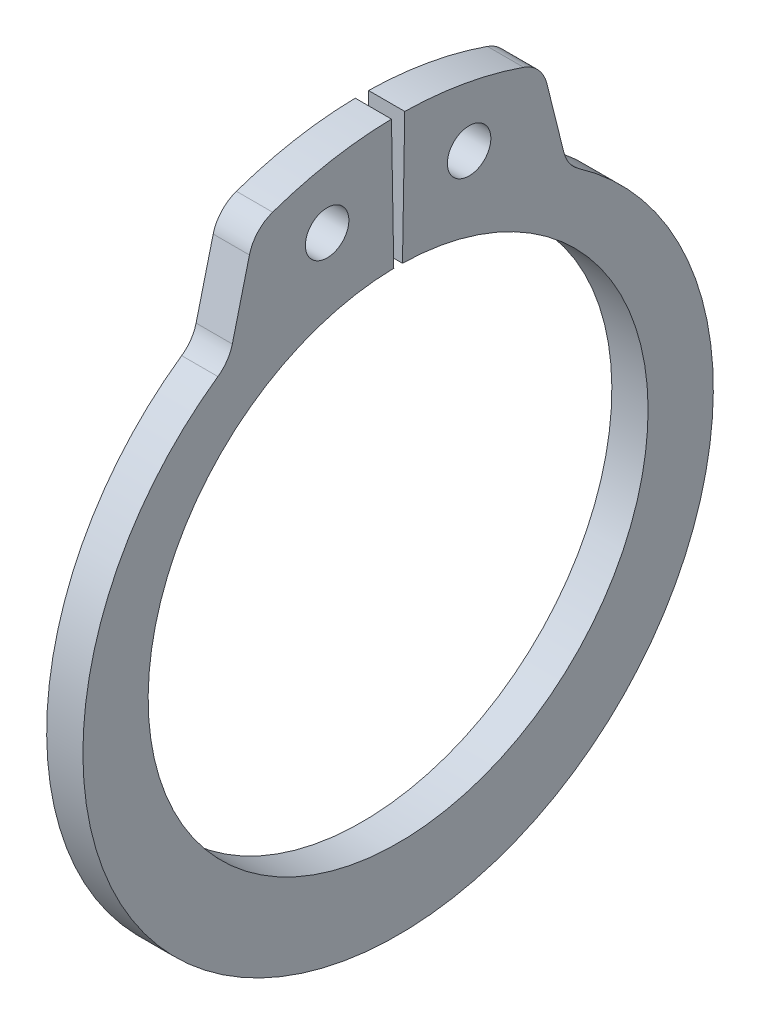
ISO-10303-21;
HEADER;
FILE_DESCRIPTION(('STEP AP214'),'2;1');
FILE_NAME('part.step','',(''),(''),'','','');
FILE_SCHEMA(('AUTOMOTIVE_DESIGN { 1 0 10303 214 1 1 1 1 }'));
ENDSEC;
DATA;
#1=APPLICATION_CONTEXT('core data for automotive mechanical design processes');
#2=APPLICATION_PROTOCOL_DEFINITION('international standard','automotive_design',2000,#1);
#3=PRODUCT_CONTEXT('',#1,'mechanical');
#4=PRODUCT('Part','Part','',(#3));
#5=PRODUCT_RELATED_PRODUCT_CATEGORY('part','',(#4));
#6=PRODUCT_DEFINITION_FORMATION('','',#4);
#7=PRODUCT_DEFINITION_CONTEXT('part definition',#1,'design');
#8=PRODUCT_DEFINITION('design','',#6,#7);
#9=PRODUCT_DEFINITION_SHAPE('','',#8);
#10=(LENGTH_UNIT() NAMED_UNIT(*) SI_UNIT(.MILLI.,.METRE.));
#11=(NAMED_UNIT(*) PLANE_ANGLE_UNIT() SI_UNIT($,.RADIAN.));
#12=(NAMED_UNIT(*) SI_UNIT($,.STERADIAN.) SOLID_ANGLE_UNIT());
#13=UNCERTAINTY_MEASURE_WITH_UNIT(LENGTH_MEASURE(1.E-05),#10,'distance_accuracy_value','');
#14=(GEOMETRIC_REPRESENTATION_CONTEXT(3) GLOBAL_UNCERTAINTY_ASSIGNED_CONTEXT((#13)) GLOBAL_UNIT_ASSIGNED_CONTEXT((#10,
#11,#12)) REPRESENTATION_CONTEXT('',''));
#15=CARTESIAN_POINT('',(0.,0.,0.));
#16=DIRECTION('',(0.,0.,1.));
#17=DIRECTION('',(1.,0.,0.));
#18=AXIS2_PLACEMENT_3D('',#15,#16,#17);
#19=CARTESIAN_POINT('',(-0.5,0.,0.));
#20=DIRECTION('',(1.,0.,0.));
#21=DIRECTION('',(0.,0.,-1.));
#22=AXIS2_PLACEMENT_3D('',#19,#20,#21);
#23=PLANE('',#22);
#24=CARTESIAN_POINT('',(-0.5,8.66711980549086,-1.9596288316201));
#25=DIRECTION('',(-1.,0.,0.));
#26=DIRECTION('',(0.,0.,1.));
#27=AXIS2_PLACEMENT_3D('',#24,#25,#26);
#28=CIRCLE('',#27,0.6);
#29=CARTESIAN_POINT('',(-0.5,8.66711980549086,-1.3596288316201));
#30=VERTEX_POINT('',#29);
#31=EDGE_CURVE('E126',#30,#30,#28,.F.);
#32=ORIENTED_EDGE('',*,*,#31,.T.);
#33=EDGE_LOOP('',(#32));
#34=FACE_BOUND('',#33,.T.);
#35=CARTESIAN_POINT('',(-0.5,8.96816184312502,3.13401869099666));
#36=DIRECTION('',(-1.,0.,0.));
#37=DIRECTION('',(0.,0.,1.));
#38=AXIS2_PLACEMENT_3D('',#35,#36,#37);
#39=CIRCLE('',#38,1.);
#40=CARTESIAN_POINT('',(-0.5,9.91217887924345,3.46391539531209));
#41=VERTEX_POINT('',#40);
#42=CARTESIAN_POINT('',(-0.5,9.21008373872469,4.10431441727265));
#43=VERTEX_POINT('',#42);
#44=EDGE_CURVE('E112',#41,#43,#39,.F.);
#45=ORIENTED_EDGE('',*,*,#44,.F.);
#46=CARTESIAN_POINT('',(-0.5,0.,0.));
#47=DIRECTION('',(-1.,0.,0.));
#48=DIRECTION('',(0.,0.,1.));
#49=AXIS2_PLACEMENT_3D('',#46,#47,#48);
#50=CIRCLE('',#49,10.5);
#51=CARTESIAN_POINT('',(-0.5,10.4984007991421,0.183250267591477));
#52=VERTEX_POINT('',#51);
#53=EDGE_CURVE('E105',#52,#41,#50,.F.);
#54=ORIENTED_EDGE('',*,*,#53,.F.);
#55=DIRECTION('',(0.,-0.999847695156391,-0.0174524064372835));
#56=VECTOR('',#55,1.);
#57=CARTESIAN_POINT('',(-0.5,6.8989490965791,0.120421604417256));
#58=LINE('',#57,#56);
#59=CARTESIAN_POINT('',(-0.5,6.8989490965791,0.120421604417256));
#60=VERTEX_POINT('',#59);
#61=EDGE_CURVE('E109',#52,#60,#58,.T.);
#62=ORIENTED_EDGE('',*,*,#61,.T.);
#63=CARTESIAN_POINT('',(-0.5,0.,0.));
#64=DIRECTION('',(-1.,0.,0.));
#65=DIRECTION('',(0.,0.,1.));
#66=AXIS2_PLACEMENT_3D('',#63,#64,#65);
#67=CIRCLE('',#66,6.9);
#68=CARTESIAN_POINT('',(-0.5,6.8989490965791,-0.120421604417256));
#69=VERTEX_POINT('',#68);
#70=EDGE_CURVE('E172',#60,#69,#67,.F.);
#71=ORIENTED_EDGE('',*,*,#70,.T.);
#72=DIRECTION('',(0.,0.999847695156391,-0.0174524064372841));
#73=VECTOR('',#72,1.);
#74=CARTESIAN_POINT('',(-0.5,10.4984007991421,-0.183250267591479));
#75=LINE('',#74,#73);
#76=CARTESIAN_POINT('',(-0.5,10.4984007991421,-0.183250267591479));
#77=VERTEX_POINT('',#76);
#78=EDGE_CURVE('E134',#69,#77,#75,.T.);
#79=ORIENTED_EDGE('',*,*,#78,.T.);
#80=CARTESIAN_POINT('',(-0.5,0.,0.));
#81=DIRECTION('',(-1.,0.,0.));
#82=DIRECTION('',(0.,0.,1.));
#83=AXIS2_PLACEMENT_3D('',#80,#81,#82);
#84=CIRCLE('',#83,10.5);
#85=CARTESIAN_POINT('',(-0.5,9.91217887924345,-3.46391539531209));
#86=VERTEX_POINT('',#85);
#87=EDGE_CURVE('E174',#86,#77,#84,.F.);
#88=ORIENTED_EDGE('',*,*,#87,.F.);
#89=CARTESIAN_POINT('',(-0.5,8.96816184312502,-3.13401869099665));
#90=DIRECTION('',(-1.,0.,0.));
#91=DIRECTION('',(0.,0.,1.));
#92=AXIS2_PLACEMENT_3D('',#89,#90,#91);
#93=CIRCLE('',#92,1.);
#94=CARTESIAN_POINT('',(-0.5,9.21008373872469,-4.10431441727265));
#95=VERTEX_POINT('',#94);
#96=EDGE_CURVE('E177',#95,#86,#93,.F.);
#97=ORIENTED_EDGE('',*,*,#96,.F.);
#98=DIRECTION('',(0.,-0.970295726275997,-0.241921895599666));
#99=VECTOR('',#98,1.);
#100=CARTESIAN_POINT('',(-0.5,9.71734472745919,-3.97784004803122));
#101=LINE('',#100,#99);
#102=CARTESIAN_POINT('',(-0.5,7.31761530924591,-4.57615979123836));
#103=VERTEX_POINT('',#102);
#104=EDGE_CURVE('E139',#95,#103,#101,.T.);
#105=ORIENTED_EDGE('',*,*,#104,.T.);
#106=CARTESIAN_POINT('',(-0.5,7.55953720484558,-5.54645551751436));
#107=DIRECTION('',(-1.,0.,0.));
#108=DIRECTION('',(0.,0.,1.));
#109=AXIS2_PLACEMENT_3D('',#106,#107,#108);
#110=CIRCLE('',#109,1.);
#111=CARTESIAN_POINT('',(-0.5,6.73911195964233,-4.97470170945253));
#112=VERTEX_POINT('',#111);
#113=EDGE_CURVE('E179',#103,#112,#110,.F.);
#114=ORIENTED_EDGE('',*,*,#113,.T.);
#115=CARTESIAN_POINT('',(-0.5,-0.399224177769538,0.));
#116=DIRECTION('',(-1.,0.,0.));
#117=DIRECTION('',(0.,0.,1.));
#118=AXIS2_PLACEMENT_3D('',#115,#116,#117);
#119=CIRCLE('',#118,8.70077582223046);
#120=CARTESIAN_POINT('',(-0.5,6.73911195964233,4.97470170945253));
#121=VERTEX_POINT('',#120);
#122=EDGE_CURVE('E182',#121,#112,#119,.F.);
#123=ORIENTED_EDGE('',*,*,#122,.F.);
#124=CARTESIAN_POINT('',(-0.5,7.55953720484558,5.54645551751436));
#125=DIRECTION('',(-1.,0.,0.));
#126=DIRECTION('',(0.,0.,1.));
#127=AXIS2_PLACEMENT_3D('',#124,#125,#126);
#128=CIRCLE('',#127,1.);
#129=CARTESIAN_POINT('',(-0.5,7.31761530924591,4.57615979123836));
#130=VERTEX_POINT('',#129);
#131=EDGE_CURVE('E145',#121,#130,#128,.F.);
#132=ORIENTED_EDGE('',*,*,#131,.T.);
#133=DIRECTION('',(0.,0.970295726275997,-0.241921895599665));
#134=VECTOR('',#133,1.);
#135=CARTESIAN_POINT('',(-0.5,9.71734472745919,3.97784004803122));
#136=LINE('',#135,#134);
#137=EDGE_CURVE('E144',#130,#43,#136,.T.);
#138=ORIENTED_EDGE('',*,*,#137,.T.);
#139=EDGE_LOOP('',(#45,#54,#62,#71,#79,#88,#97,#105,#114,#123,#132,#138));
#140=FACE_BOUND('',#139,.T.);
#141=CARTESIAN_POINT('',(-0.5,8.66711980549086,1.9596288316201));
#142=DIRECTION('',(-1.,0.,0.));
#143=DIRECTION('',(0.,0.,1.));
#144=AXIS2_PLACEMENT_3D('',#141,#142,#143);
#145=CIRCLE('',#144,0.6);
#146=CARTESIAN_POINT('',(-0.5,8.66711980549086,2.5596288316201));
#147=VERTEX_POINT('',#146);
#148=EDGE_CURVE('E20',#147,#147,#145,.F.);
#149=ORIENTED_EDGE('',*,*,#148,.T.);
#150=EDGE_LOOP('',(#149));
#151=FACE_BOUND('',#150,.T.);
#152=ADVANCED_FACE('F17',(#34,#140,#151),#23,.F.);
#153=CARTESIAN_POINT('',(0.5,8.66711980549086,1.9596288316201));
#154=DIRECTION('',(-1.,0.,0.));
#155=DIRECTION('',(0.,0.,1.));
#156=AXIS2_PLACEMENT_3D('',#153,#154,#155);
#157=CYLINDRICAL_SURFACE('',#156,0.6);
#158=CARTESIAN_POINT('',(0.5,8.66711980549086,1.9596288316201));
#159=DIRECTION('',(-1.,0.,0.));
#160=DIRECTION('',(0.,0.,1.));
#161=AXIS2_PLACEMENT_3D('',#158,#159,#160);
#162=CIRCLE('',#161,0.6);
#163=CARTESIAN_POINT('',(0.5,8.66711980549086,2.5596288316201));
#164=VERTEX_POINT('',#163);
#165=EDGE_CURVE('E129',#164,#164,#162,.T.);
#166=ORIENTED_EDGE('',*,*,#165,.F.);
#167=EDGE_LOOP('',(#166));
#168=FACE_BOUND('',#167,.T.);
#169=ORIENTED_EDGE('',*,*,#148,.F.);
#170=EDGE_LOOP('',(#169));
#171=FACE_BOUND('',#170,.T.);
#172=ADVANCED_FACE('F272',(#168,#171),#157,.F.);
#173=CARTESIAN_POINT('',(0.5,0.,0.));
#174=DIRECTION('',(-1.,0.,0.));
#175=DIRECTION('',(0.,0.,1.));
#176=AXIS2_PLACEMENT_3D('',#173,#174,#175);
#177=CYLINDRICAL_SURFACE('',#176,10.5);
#178=CARTESIAN_POINT('',(0.5,0.,0.));
#179=DIRECTION('',(-1.,0.,0.));
#180=DIRECTION('',(0.,0.,1.));
#181=AXIS2_PLACEMENT_3D('',#178,#179,#180);
#182=CIRCLE('',#181,10.5);
#183=CARTESIAN_POINT('',(0.5,10.4984007991421,0.183250267591477));
#184=VERTEX_POINT('',#183);
#185=CARTESIAN_POINT('',(0.5,9.91217887924345,3.46391539531209));
#186=VERTEX_POINT('',#185);
#187=EDGE_CURVE('E120',#184,#186,#182,.F.);
#188=ORIENTED_EDGE('',*,*,#187,.F.);
#189=DIRECTION('',(1.,0.,0.));
#190=VECTOR('',#189,1.);
#191=CARTESIAN_POINT('',(0.5,10.4984007991421,0.183250267591477));
#192=LINE('',#191,#190);
#193=EDGE_CURVE('E117',#184,#52,#192,.F.);
#194=ORIENTED_EDGE('',*,*,#193,.T.);
#195=ORIENTED_EDGE('',*,*,#53,.T.);
#196=DIRECTION('',(-1.,0.,0.));
#197=VECTOR('',#196,1.);
#198=CARTESIAN_POINT('',(0.5,9.91217887924345,3.46391539531209));
#199=LINE('',#198,#197);
#200=EDGE_CURVE('E115',#186,#41,#199,.T.);
#201=ORIENTED_EDGE('',*,*,#200,.F.);
#202=EDGE_LOOP('',(#188,#194,#195,#201));
#203=FACE_BOUND('',#202,.T.);
#204=ADVANCED_FACE('F118',(#203),#177,.T.);
#205=CARTESIAN_POINT('',(0.5,8.96816184312502,3.13401869099666));
#206=DIRECTION('',(-1.,0.,0.));
#207=DIRECTION('',(0.,0.,1.));
#208=AXIS2_PLACEMENT_3D('',#205,#206,#207);
#209=CYLINDRICAL_SURFACE('',#208,1.);
#210=ORIENTED_EDGE('',*,*,#44,.T.);
#211=DIRECTION('',(1.,0.,0.));
#212=VECTOR('',#211,1.);
#213=CARTESIAN_POINT('',(0.5,9.21008373872469,4.10431441727265));
#214=LINE('',#213,#212);
#215=CARTESIAN_POINT('',(0.5,9.21008373872469,4.10431441727265));
#216=VERTEX_POINT('',#215);
#217=EDGE_CURVE('E146',#43,#216,#214,.T.);
#218=ORIENTED_EDGE('',*,*,#217,.T.);
#219=CARTESIAN_POINT('',(0.5,8.96816184312502,3.13401869099666));
#220=DIRECTION('',(-1.,0.,0.));
#221=DIRECTION('',(0.,0.,1.));
#222=AXIS2_PLACEMENT_3D('',#219,#220,#221);
#223=CIRCLE('',#222,1.);
#224=EDGE_CURVE('E166',#186,#216,#223,.F.);
#225=ORIENTED_EDGE('',*,*,#224,.F.);
#226=ORIENTED_EDGE('',*,*,#200,.T.);
#227=EDGE_LOOP('',(#210,#218,#225,#226));
#228=FACE_BOUND('',#227,.T.);
#229=ADVANCED_FACE('F190',(#228),#209,.T.);
#230=CARTESIAN_POINT('',(0.5,9.71734472745919,3.97784004803122));
#231=DIRECTION('',(0.,-0.241921895599665,-0.970295726275997));
#232=DIRECTION('',(0.,0.970295726275997,-0.241921895599665));
#233=AXIS2_PLACEMENT_3D('',#230,#231,#232);
#234=PLANE('',#233);
#235=DIRECTION('',(-1.,0.,0.));
#236=VECTOR('',#235,1.);
#237=CARTESIAN_POINT('',(0.5,7.31761530924591,4.57615979123836));
#238=LINE('',#237,#236);
#239=CARTESIAN_POINT('',(0.5,7.31761530924591,4.57615979123836));
#240=VERTEX_POINT('',#239);
#241=EDGE_CURVE('E187',#130,#240,#238,.F.);
#242=ORIENTED_EDGE('',*,*,#241,.T.);
#243=DIRECTION('',(0.,-0.970295726275997,0.241921895599665));
#244=VECTOR('',#243,1.);
#245=CARTESIAN_POINT('',(0.5,9.21008373872469,4.10431441727265));
#246=LINE('',#245,#244);
#247=EDGE_CURVE('E165',#216,#240,#246,.T.);
#248=ORIENTED_EDGE('',*,*,#247,.F.);
#249=ORIENTED_EDGE('',*,*,#217,.F.);
#250=ORIENTED_EDGE('',*,*,#137,.F.);
#251=EDGE_LOOP('',(#242,#248,#249,#250));
#252=FACE_BOUND('',#251,.T.);
#253=ADVANCED_FACE('F218',(#252),#234,.F.);
#254=CARTESIAN_POINT('',(0.5,7.55953720484558,5.54645551751436));
#255=DIRECTION('',(-1.,0.,0.));
#256=DIRECTION('',(0.,0.,1.));
#257=AXIS2_PLACEMENT_3D('',#254,#255,#256);
#258=CYLINDRICAL_SURFACE('',#257,1.);
#259=ORIENTED_EDGE('',*,*,#241,.F.);
#260=ORIENTED_EDGE('',*,*,#131,.F.);
#261=DIRECTION('',(-1.,0.,0.));
#262=VECTOR('',#261,1.);
#263=CARTESIAN_POINT('',(0.5,6.73911195964233,4.97470170945253));
#264=LINE('',#263,#262);
#265=CARTESIAN_POINT('',(0.5,6.73911195964233,4.97470170945253));
#266=VERTEX_POINT('',#265);
#267=EDGE_CURVE('E185',#266,#121,#264,.T.);
#268=ORIENTED_EDGE('',*,*,#267,.F.);
#269=CARTESIAN_POINT('',(0.5,7.55953720484558,5.54645551751436));
#270=DIRECTION('',(-1.,0.,0.));
#271=DIRECTION('',(0.,0.,1.));
#272=AXIS2_PLACEMENT_3D('',#269,#270,#271);
#273=CIRCLE('',#272,1.);
#274=EDGE_CURVE('E162',#240,#266,#273,.T.);
#275=ORIENTED_EDGE('',*,*,#274,.F.);
#276=EDGE_LOOP('',(#259,#260,#268,#275));
#277=FACE_BOUND('',#276,.T.);
#278=ADVANCED_FACE('F221',(#277),#258,.F.);
#279=CARTESIAN_POINT('',(0.5,-0.399224177769538,0.));
#280=DIRECTION('',(-1.,0.,0.));
#281=DIRECTION('',(0.,0.,1.));
#282=AXIS2_PLACEMENT_3D('',#279,#280,#281);
#283=CYLINDRICAL_SURFACE('',#282,8.70077582223046);
#284=ORIENTED_EDGE('',*,*,#122,.T.);
#285=DIRECTION('',(-1.,0.,0.));
#286=VECTOR('',#285,1.);
#287=CARTESIAN_POINT('',(0.5,6.73911195964233,-4.97470170945253));
#288=LINE('',#287,#286);
#289=CARTESIAN_POINT('',(0.5,6.73911195964233,-4.97470170945253));
#290=VERTEX_POINT('',#289);
#291=EDGE_CURVE('E181',#112,#290,#288,.F.);
#292=ORIENTED_EDGE('',*,*,#291,.T.);
#293=CARTESIAN_POINT('',(0.5,-0.399224177769538,0.));
#294=DIRECTION('',(-1.,0.,0.));
#295=DIRECTION('',(0.,0.,1.));
#296=AXIS2_PLACEMENT_3D('',#293,#294,#295);
#297=CIRCLE('',#296,8.70077582223046);
#298=EDGE_CURVE('E160',#266,#290,#297,.F.);
#299=ORIENTED_EDGE('',*,*,#298,.F.);
#300=ORIENTED_EDGE('',*,*,#267,.T.);
#301=EDGE_LOOP('',(#284,#292,#299,#300));
#302=FACE_BOUND('',#301,.T.);
#303=ADVANCED_FACE('F226',(#302),#283,.T.);
#304=CARTESIAN_POINT('',(0.5,7.55953720484558,-5.54645551751436));
#305=DIRECTION('',(-1.,0.,0.));
#306=DIRECTION('',(0.,0.,1.));
#307=AXIS2_PLACEMENT_3D('',#304,#305,#306);
#308=CYLINDRICAL_SURFACE('',#307,1.);
#309=ORIENTED_EDGE('',*,*,#291,.F.);
#310=ORIENTED_EDGE('',*,*,#113,.F.);
#311=DIRECTION('',(1.,0.,0.));
#312=VECTOR('',#311,1.);
#313=CARTESIAN_POINT('',(0.5,7.31761530924591,-4.57615979123836));
#314=LINE('',#313,#312);
#315=CARTESIAN_POINT('',(0.5,7.31761530924591,-4.57615979123836));
#316=VERTEX_POINT('',#315);
#317=EDGE_CURVE('E143',#103,#316,#314,.T.);
#318=ORIENTED_EDGE('',*,*,#317,.T.);
#319=CARTESIAN_POINT('',(0.5,7.55953720484558,-5.54645551751436));
#320=DIRECTION('',(-1.,0.,0.));
#321=DIRECTION('',(0.,0.,1.));
#322=AXIS2_PLACEMENT_3D('',#319,#320,#321);
#323=CIRCLE('',#322,1.);
#324=EDGE_CURVE('E157',#290,#316,#323,.T.);
#325=ORIENTED_EDGE('',*,*,#324,.F.);
#326=EDGE_LOOP('',(#309,#310,#318,#325));
#327=FACE_BOUND('',#326,.T.);
#328=ADVANCED_FACE('F228',(#327),#308,.F.);
#329=CARTESIAN_POINT('',(0.5,9.71734472745919,-3.97784004803122));
#330=DIRECTION('',(0.,-0.241921895599666,0.970295726275997));
#331=DIRECTION('',(0.,-0.970295726275997,-0.241921895599666));
#332=AXIS2_PLACEMENT_3D('',#329,#330,#331);
#333=PLANE('',#332);
#334=DIRECTION('',(-1.,0.,0.));
#335=VECTOR('',#334,1.);
#336=CARTESIAN_POINT('',(0.5,9.21008373872469,-4.10431441727265));
#337=LINE('',#336,#335);
#338=CARTESIAN_POINT('',(0.5,9.21008373872469,-4.10431441727265));
#339=VERTEX_POINT('',#338);
#340=EDGE_CURVE('E142',#339,#95,#337,.T.);
#341=ORIENTED_EDGE('',*,*,#340,.F.);
#342=DIRECTION('',(0.,0.970295726275997,0.241921895599666));
#343=VECTOR('',#342,1.);
#344=CARTESIAN_POINT('',(0.5,7.31761530924591,-4.57615979123836));
#345=LINE('',#344,#343);
#346=EDGE_CURVE('E156',#316,#339,#345,.T.);
#347=ORIENTED_EDGE('',*,*,#346,.F.);
#348=ORIENTED_EDGE('',*,*,#317,.F.);
#349=ORIENTED_EDGE('',*,*,#104,.F.);
#350=EDGE_LOOP('',(#341,#347,#348,#349));
#351=FACE_BOUND('',#350,.T.);
#352=ADVANCED_FACE('F232',(#351),#333,.F.);
#353=CARTESIAN_POINT('',(0.5,8.96816184312502,-3.13401869099665));
#354=DIRECTION('',(-1.,0.,0.));
#355=DIRECTION('',(0.,0.,1.));
#356=AXIS2_PLACEMENT_3D('',#353,#354,#355);
#357=CYLINDRICAL_SURFACE('',#356,1.);
#358=ORIENTED_EDGE('',*,*,#96,.T.);
#359=DIRECTION('',(-1.,0.,0.));
#360=VECTOR('',#359,1.);
#361=CARTESIAN_POINT('',(0.5,9.91217887924345,-3.46391539531209));
#362=LINE('',#361,#360);
#363=CARTESIAN_POINT('',(0.5,9.91217887924345,-3.46391539531209));
#364=VERTEX_POINT('',#363);
#365=EDGE_CURVE('E176',#364,#86,#362,.T.);
#366=ORIENTED_EDGE('',*,*,#365,.F.);
#367=CARTESIAN_POINT('',(0.5,8.96816184312502,-3.13401869099665));
#368=DIRECTION('',(-1.,0.,0.));
#369=DIRECTION('',(0.,0.,1.));
#370=AXIS2_PLACEMENT_3D('',#367,#368,#369);
#371=CIRCLE('',#370,1.);
#372=EDGE_CURVE('E153',#339,#364,#371,.F.);
#373=ORIENTED_EDGE('',*,*,#372,.F.);
#374=ORIENTED_EDGE('',*,*,#340,.T.);
#375=EDGE_LOOP('',(#358,#366,#373,#374));
#376=FACE_BOUND('',#375,.T.);
#377=ADVANCED_FACE('F236',(#376),#357,.T.);
#378=CARTESIAN_POINT('',(0.5,0.,0.));
#379=DIRECTION('',(-1.,0.,0.));
#380=DIRECTION('',(0.,0.,1.));
#381=AXIS2_PLACEMENT_3D('',#378,#379,#380);
#382=CYLINDRICAL_SURFACE('',#381,10.5);
#383=ORIENTED_EDGE('',*,*,#87,.T.);
#384=DIRECTION('',(1.,0.,0.));
#385=VECTOR('',#384,1.);
#386=CARTESIAN_POINT('',(0.5,10.4984007991421,-0.183250267591479));
#387=LINE('',#386,#385);
#388=CARTESIAN_POINT('',(0.5,10.4984007991421,-0.183250267591479));
#389=VERTEX_POINT('',#388);
#390=EDGE_CURVE('E138',#77,#389,#387,.T.);
#391=ORIENTED_EDGE('',*,*,#390,.T.);
#392=CARTESIAN_POINT('',(0.5,0.,0.));
#393=DIRECTION('',(-1.,0.,0.));
#394=DIRECTION('',(0.,0.,1.));
#395=AXIS2_PLACEMENT_3D('',#392,#393,#394);
#396=CIRCLE('',#395,10.5);
#397=EDGE_CURVE('E150',#364,#389,#396,.F.);
#398=ORIENTED_EDGE('',*,*,#397,.F.);
#399=ORIENTED_EDGE('',*,*,#365,.T.);
#400=EDGE_LOOP('',(#383,#391,#398,#399));
#401=FACE_BOUND('',#400,.T.);
#402=ADVANCED_FACE('F240',(#401),#382,.T.);
#403=CARTESIAN_POINT('',(0.5,10.4984007991421,-0.183250267591479));
#404=DIRECTION('',(0.,-0.0174524064372841,-0.999847695156391));
#405=DIRECTION('',(0.,0.999847695156391,-0.0174524064372841));
#406=AXIS2_PLACEMENT_3D('',#403,#404,#405);
#407=PLANE('',#406);
#408=DIRECTION('',(-1.,0.,0.));
#409=VECTOR('',#408,1.);
#410=CARTESIAN_POINT('',(0.5,6.8989490965791,-0.120421604417256));
#411=LINE('',#410,#409);
#412=CARTESIAN_POINT('',(0.5,6.8989490965791,-0.120421604417256));
#413=VERTEX_POINT('',#412);
#414=EDGE_CURVE('E137',#69,#413,#411,.F.);
#415=ORIENTED_EDGE('',*,*,#414,.T.);
#416=DIRECTION('',(0.,-0.999847695156391,0.017452406437284));
#417=VECTOR('',#416,1.);
#418=CARTESIAN_POINT('',(0.5,10.4984007991421,-0.183250267591479));
#419=LINE('',#418,#417);
#420=EDGE_CURVE('E149',#389,#413,#419,.T.);
#421=ORIENTED_EDGE('',*,*,#420,.F.);
#422=ORIENTED_EDGE('',*,*,#390,.F.);
#423=ORIENTED_EDGE('',*,*,#78,.F.);
#424=EDGE_LOOP('',(#415,#421,#422,#423));
#425=FACE_BOUND('',#424,.T.);
#426=ADVANCED_FACE('F245',(#425),#407,.F.);
#427=CARTESIAN_POINT('',(0.5,0.,0.));
#428=DIRECTION('',(-1.,0.,0.));
#429=DIRECTION('',(0.,0.,1.));
#430=AXIS2_PLACEMENT_3D('',#427,#428,#429);
#431=CYLINDRICAL_SURFACE('',#430,6.9);
#432=DIRECTION('',(1.,0.,0.));
#433=VECTOR('',#432,1.);
#434=CARTESIAN_POINT('',(0.5,6.8989490965791,0.120421604417256));
#435=LINE('',#434,#433);
#436=CARTESIAN_POINT('',(0.5,6.8989490965791,0.120421604417256));
#437=VERTEX_POINT('',#436);
#438=EDGE_CURVE('E123',#60,#437,#435,.T.);
#439=ORIENTED_EDGE('',*,*,#438,.T.);
#440=CARTESIAN_POINT('',(0.5,0.,0.));
#441=DIRECTION('',(-1.,0.,0.));
#442=DIRECTION('',(0.,0.,1.));
#443=AXIS2_PLACEMENT_3D('',#440,#441,#442);
#444=CIRCLE('',#443,6.9);
#445=EDGE_CURVE('E35',#413,#437,#444,.T.);
#446=ORIENTED_EDGE('',*,*,#445,.F.);
#447=ORIENTED_EDGE('',*,*,#414,.F.);
#448=ORIENTED_EDGE('',*,*,#70,.F.);
#449=EDGE_LOOP('',(#439,#446,#447,#448));
#450=FACE_BOUND('',#449,.T.);
#451=ADVANCED_FACE('F248',(#450),#431,.F.);
#452=CARTESIAN_POINT('',(0.5,6.8989490965791,0.120421604417256));
#453=DIRECTION('',(0.,-0.0174524064372835,0.999847695156391));
#454=DIRECTION('',(0.,-0.999847695156391,-0.0174524064372835));
#455=AXIS2_PLACEMENT_3D('',#452,#453,#454);
#456=PLANE('',#455);
#457=ORIENTED_EDGE('',*,*,#193,.F.);
#458=DIRECTION('',(0.,0.999847695156391,0.0174524064372835));
#459=VECTOR('',#458,1.);
#460=CARTESIAN_POINT('',(0.5,6.8989490965791,0.120421604417256));
#461=LINE('',#460,#459);
#462=EDGE_CURVE('E26',#437,#184,#461,.T.);
#463=ORIENTED_EDGE('',*,*,#462,.F.);
#464=ORIENTED_EDGE('',*,*,#438,.F.);
#465=ORIENTED_EDGE('',*,*,#61,.F.);
#466=EDGE_LOOP('',(#457,#463,#464,#465));
#467=FACE_BOUND('',#466,.T.);
#468=ADVANCED_FACE('F125',(#467),#456,.F.);
#469=CARTESIAN_POINT('',(0.5,8.66711980549086,-1.9596288316201));
#470=DIRECTION('',(-1.,0.,0.));
#471=DIRECTION('',(0.,0.,1.));
#472=AXIS2_PLACEMENT_3D('',#469,#470,#471);
#473=CYLINDRICAL_SURFACE('',#472,0.6);
#474=CARTESIAN_POINT('',(0.5,8.66711980549086,-1.9596288316201));
#475=DIRECTION('',(-1.,0.,0.));
#476=DIRECTION('',(0.,0.,1.));
#477=AXIS2_PLACEMENT_3D('',#474,#475,#476);
#478=CIRCLE('',#477,0.6);
#479=CARTESIAN_POINT('',(0.5,8.66711980549086,-1.3596288316201));
#480=VERTEX_POINT('',#479);
#481=EDGE_CURVE('E11',#480,#480,#478,.T.);
#482=ORIENTED_EDGE('',*,*,#481,.F.);
#483=EDGE_LOOP('',(#482));
#484=FACE_BOUND('',#483,.T.);
#485=ORIENTED_EDGE('',*,*,#31,.F.);
#486=EDGE_LOOP('',(#485));
#487=FACE_BOUND('',#486,.T.);
#488=ADVANCED_FACE('F256',(#484,#487),#473,.F.);
#489=CARTESIAN_POINT('',(0.5,0.,0.));
#490=DIRECTION('',(1.,0.,0.));
#491=DIRECTION('',(0.,0.,-1.));
#492=AXIS2_PLACEMENT_3D('',#489,#490,#491);
#493=PLANE('',#492);
#494=ORIENTED_EDGE('',*,*,#481,.T.);
#495=EDGE_LOOP('',(#494));
#496=FACE_BOUND('',#495,.T.);
#497=ORIENTED_EDGE('',*,*,#445,.T.);
#498=ORIENTED_EDGE('',*,*,#462,.T.);
#499=ORIENTED_EDGE('',*,*,#187,.T.);
#500=ORIENTED_EDGE('',*,*,#224,.T.);
#501=ORIENTED_EDGE('',*,*,#247,.T.);
#502=ORIENTED_EDGE('',*,*,#274,.T.);
#503=ORIENTED_EDGE('',*,*,#298,.T.);
#504=ORIENTED_EDGE('',*,*,#324,.T.);
#505=ORIENTED_EDGE('',*,*,#346,.T.);
#506=ORIENTED_EDGE('',*,*,#372,.T.);
#507=ORIENTED_EDGE('',*,*,#397,.T.);
#508=ORIENTED_EDGE('',*,*,#420,.T.);
#509=EDGE_LOOP('',(#497,#498,#499,#500,#501,#502,#503,#504,#505,#506,#507,#508));
#510=FACE_BOUND('',#509,.T.);
#511=ORIENTED_EDGE('',*,*,#165,.T.);
#512=EDGE_LOOP('',(#511));
#513=FACE_BOUND('',#512,.T.);
#514=ADVANCED_FACE('F194',(#496,#510,#513),#493,.T.);
#515=CLOSED_SHELL('',(#152,#172,#204,#229,#253,#278,#303,#328,#352,#377,#402,#426,#451,#468,
#488,#514));
#516=MANIFOLD_SOLID_BREP('B1',#515);
#517=ADVANCED_BREP_SHAPE_REPRESENTATION('',(#18,#516),#14);
#518=SHAPE_DEFINITION_REPRESENTATION(#9,#517);
ENDSEC;
END-ISO-10303-21;
